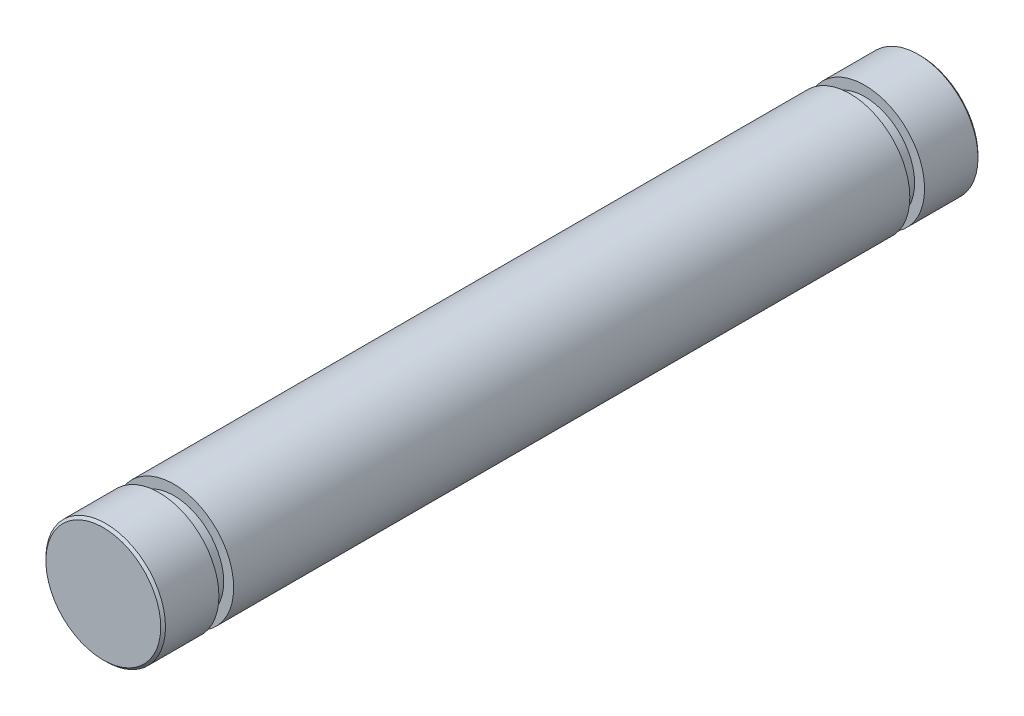
ISO-10303-21;
HEADER;
FILE_DESCRIPTION(('STEP AP214'),'2;1');
FILE_NAME('part.step','',(''),(''),'','','');
FILE_SCHEMA(('AUTOMOTIVE_DESIGN { 1 0 10303 214 1 1 1 1 }'));
ENDSEC;
DATA;
#1=APPLICATION_CONTEXT('core data for automotive mechanical design processes');
#2=APPLICATION_PROTOCOL_DEFINITION('international standard','automotive_design',2000,#1);
#3=PRODUCT_CONTEXT('',#1,'mechanical');
#4=PRODUCT('Part','Part','',(#3));
#5=PRODUCT_RELATED_PRODUCT_CATEGORY('part','',(#4));
#6=PRODUCT_DEFINITION_FORMATION('','',#4);
#7=PRODUCT_DEFINITION_CONTEXT('part definition',#1,'design');
#8=PRODUCT_DEFINITION('design','',#6,#7);
#9=PRODUCT_DEFINITION_SHAPE('','',#8);
#10=(LENGTH_UNIT() NAMED_UNIT(*) SI_UNIT(.MILLI.,.METRE.));
#11=(NAMED_UNIT(*) PLANE_ANGLE_UNIT() SI_UNIT($,.RADIAN.));
#12=(NAMED_UNIT(*) SI_UNIT($,.STERADIAN.) SOLID_ANGLE_UNIT());
#13=UNCERTAINTY_MEASURE_WITH_UNIT(LENGTH_MEASURE(1.E-05),#10,'distance_accuracy_value','');
#14=(GEOMETRIC_REPRESENTATION_CONTEXT(3) GLOBAL_UNCERTAINTY_ASSIGNED_CONTEXT((#13)) GLOBAL_UNIT_ASSIGNED_CONTEXT((#10,
#11,#12)) REPRESENTATION_CONTEXT('',''));
#15=CARTESIAN_POINT('',(0.,0.,0.));
#16=DIRECTION('',(0.,0.,1.));
#17=DIRECTION('',(1.,0.,0.));
#18=AXIS2_PLACEMENT_3D('',#15,#16,#17);
#19=CARTESIAN_POINT('',(0.,0.,20.5));
#20=DIRECTION('',(0.,0.,-1.));
#21=DIRECTION('',(-1.,0.,0.));
#22=AXIS2_PLACEMENT_3D('',#19,#20,#21);
#23=CYLINDRICAL_SURFACE('',#22,3.);
#24=CARTESIAN_POINT('',(0.,0.,16.96));
#25=DIRECTION('',(0.,0.,1.));
#26=DIRECTION('',(1.,0.,0.));
#27=AXIS2_PLACEMENT_3D('',#24,#25,#26);
#28=CIRCLE('',#27,3.);
#29=CARTESIAN_POINT('',(3.,0.,16.96));
#30=VERTEX_POINT('',#29);
#31=EDGE_CURVE('E61',#30,#30,#28,.T.);
#32=ORIENTED_EDGE('',*,*,#31,.F.);
#33=EDGE_LOOP('',(#32));
#34=FACE_BOUND('',#33,.T.);
#35=CARTESIAN_POINT('',(0.,0.,-16.96));
#36=DIRECTION('',(0.,0.,1.));
#37=DIRECTION('',(1.,0.,0.));
#38=AXIS2_PLACEMENT_3D('',#35,#36,#37);
#39=CIRCLE('',#38,3.);
#40=CARTESIAN_POINT('',(3.,0.,-16.96));
#41=VERTEX_POINT('',#40);
#42=EDGE_CURVE('E74',#41,#41,#39,.T.);
#43=ORIENTED_EDGE('',*,*,#42,.T.);
#44=EDGE_LOOP('',(#43));
#45=FACE_BOUND('',#44,.T.);
#46=ADVANCED_FACE('F37',(#34,#45),#23,.T.);
#47=CARTESIAN_POINT('',(0.,0.,16.96));
#48=DIRECTION('',(0.,0.,1.));
#49=DIRECTION('',(1.,0.,0.));
#50=AXIS2_PLACEMENT_3D('',#47,#48,#49);
#51=PLANE('',#50);
#52=CARTESIAN_POINT('',(0.,0.,16.96));
#53=DIRECTION('',(0.,0.,1.));
#54=DIRECTION('',(1.,0.,0.));
#55=AXIS2_PLACEMENT_3D('',#52,#53,#54);
#56=CIRCLE('',#55,2.5);
#57=CARTESIAN_POINT('',(2.5,0.,16.96));
#58=VERTEX_POINT('',#57);
#59=EDGE_CURVE('E66',#58,#58,#56,.T.);
#60=ORIENTED_EDGE('',*,*,#59,.F.);
#61=EDGE_LOOP('',(#60));
#62=FACE_BOUND('',#61,.T.);
#63=ORIENTED_EDGE('',*,*,#31,.T.);
#64=EDGE_LOOP('',(#63));
#65=FACE_BOUND('',#64,.T.);
#66=ADVANCED_FACE('F115',(#62,#65),#51,.T.);
#67=CARTESIAN_POINT('',(0.,0.,17.7));
#68=DIRECTION('',(0.,0.,1.));
#69=DIRECTION('',(1.,0.,0.));
#70=AXIS2_PLACEMENT_3D('',#67,#68,#69);
#71=PLANE('',#70);
#72=CARTESIAN_POINT('',(0.,0.,17.7));
#73=DIRECTION('',(0.,0.,1.));
#74=DIRECTION('',(1.,0.,0.));
#75=AXIS2_PLACEMENT_3D('',#72,#73,#74);
#76=CIRCLE('',#75,2.5);
#77=CARTESIAN_POINT('',(2.5,0.,17.7));
#78=VERTEX_POINT('',#77);
#79=EDGE_CURVE('E70',#78,#78,#76,.T.);
#80=ORIENTED_EDGE('',*,*,#79,.T.);
#81=EDGE_LOOP('',(#80));
#82=FACE_BOUND('',#81,.T.);
#83=CARTESIAN_POINT('',(0.,0.,17.7));
#84=DIRECTION('',(0.,0.,1.));
#85=DIRECTION('',(1.,0.,0.));
#86=AXIS2_PLACEMENT_3D('',#83,#84,#85);
#87=CIRCLE('',#86,3.);
#88=CARTESIAN_POINT('',(3.,0.,17.7));
#89=VERTEX_POINT('',#88);
#90=EDGE_CURVE('E62',#89,#89,#87,.T.);
#91=ORIENTED_EDGE('',*,*,#90,.F.);
#92=EDGE_LOOP('',(#91));
#93=FACE_BOUND('',#92,.T.);
#94=ADVANCED_FACE('F122',(#82,#93),#71,.F.);
#95=CARTESIAN_POINT('',(0.,0.,16.96));
#96=DIRECTION('',(0.,0.,1.));
#97=DIRECTION('',(1.,0.,0.));
#98=AXIS2_PLACEMENT_3D('',#95,#96,#97);
#99=CYLINDRICAL_SURFACE('',#98,2.5);
#100=ORIENTED_EDGE('',*,*,#59,.T.);
#101=EDGE_LOOP('',(#100));
#102=FACE_BOUND('',#101,.T.);
#103=ORIENTED_EDGE('',*,*,#79,.F.);
#104=EDGE_LOOP('',(#103));
#105=FACE_BOUND('',#104,.T.);
#106=ADVANCED_FACE('F144',(#102,#105),#99,.T.);
#107=CARTESIAN_POINT('',(0.,0.,20.5));
#108=DIRECTION('',(0.,0.,1.));
#109=DIRECTION('',(1.,0.,0.));
#110=AXIS2_PLACEMENT_3D('',#107,#108,#109);
#111=PLANE('',#110);
#112=CARTESIAN_POINT('',(0.,0.,20.5));
#113=DIRECTION('',(0.,0.,1.));
#114=DIRECTION('',(1.,0.,0.));
#115=AXIS2_PLACEMENT_3D('',#112,#113,#114);
#116=CIRCLE('',#115,2.88000000000001);
#117=CARTESIAN_POINT('',(2.88000000000001,0.,20.5));
#118=VERTEX_POINT('',#117);
#119=EDGE_CURVE('E10',#118,#118,#116,.T.);
#120=ORIENTED_EDGE('',*,*,#119,.T.);
#121=EDGE_LOOP('',(#120));
#122=FACE_BOUND('',#121,.T.);
#123=ADVANCED_FACE('F136',(#122),#111,.T.);
#124=CARTESIAN_POINT('',(0.,0.,20.5));
#125=DIRECTION('',(0.,0.,-1.));
#126=DIRECTION('',(-1.,0.,0.));
#127=AXIS2_PLACEMENT_3D('',#124,#125,#126);
#128=CONICAL_SURFACE('',#127,2.88000000000001,0.785398163397425);
#129=CARTESIAN_POINT('',(0.,0.,20.38));
#130=DIRECTION('',(0.,0.,1.));
#131=DIRECTION('',(1.,0.,0.));
#132=AXIS2_PLACEMENT_3D('',#129,#130,#131);
#133=CIRCLE('',#132,3.);
#134=CARTESIAN_POINT('',(3.,0.,20.38));
#135=VERTEX_POINT('',#134);
#136=EDGE_CURVE('E55',#135,#135,#133,.F.);
#137=ORIENTED_EDGE('',*,*,#136,.F.);
#138=EDGE_LOOP('',(#137));
#139=FACE_BOUND('',#138,.T.);
#140=ORIENTED_EDGE('',*,*,#119,.F.);
#141=EDGE_LOOP('',(#140));
#142=FACE_BOUND('',#141,.T.);
#143=ADVANCED_FACE('F39',(#139,#142),#128,.T.);
#144=ORIENTED_EDGE('',*,*,#90,.T.);
#145=EDGE_LOOP('',(#144));
#146=FACE_BOUND('',#145,.T.);
#147=ORIENTED_EDGE('',*,*,#136,.T.);
#148=EDGE_LOOP('',(#147));
#149=FACE_BOUND('',#148,.T.);
#150=ADVANCED_FACE('F110',(#146,#149),#23,.T.);
#151=CARTESIAN_POINT('',(0.,0.,-16.96));
#152=DIRECTION('',(0.,0.,-1.));
#153=DIRECTION('',(1.,0.,0.));
#154=AXIS2_PLACEMENT_3D('',#151,#152,#153);
#155=PLANE('',#154);
#156=ORIENTED_EDGE('',*,*,#42,.F.);
#157=EDGE_LOOP('',(#156));
#158=FACE_BOUND('',#157,.T.);
#159=CARTESIAN_POINT('',(0.,0.,-16.96));
#160=DIRECTION('',(0.,0.,1.));
#161=DIRECTION('',(1.,0.,0.));
#162=AXIS2_PLACEMENT_3D('',#159,#160,#161);
#163=CIRCLE('',#162,2.5);
#164=CARTESIAN_POINT('',(2.5,0.,-16.96));
#165=VERTEX_POINT('',#164);
#166=EDGE_CURVE('E82',#165,#165,#163,.T.);
#167=ORIENTED_EDGE('',*,*,#166,.T.);
#168=EDGE_LOOP('',(#167));
#169=FACE_BOUND('',#168,.T.);
#170=ADVANCED_FACE('F94',(#158,#169),#155,.T.);
#171=CARTESIAN_POINT('',(0.,0.,-17.7));
#172=DIRECTION('',(0.,0.,-1.));
#173=DIRECTION('',(1.,0.,0.));
#174=AXIS2_PLACEMENT_3D('',#171,#172,#173);
#175=PLANE('',#174);
#176=CARTESIAN_POINT('',(0.,0.,-17.7));
#177=DIRECTION('',(0.,0.,1.));
#178=DIRECTION('',(1.,0.,0.));
#179=AXIS2_PLACEMENT_3D('',#176,#177,#178);
#180=CIRCLE('',#179,3.);
#181=CARTESIAN_POINT('',(3.,0.,-17.7));
#182=VERTEX_POINT('',#181);
#183=EDGE_CURVE('E78',#182,#182,#180,.T.);
#184=ORIENTED_EDGE('',*,*,#183,.T.);
#185=EDGE_LOOP('',(#184));
#186=FACE_BOUND('',#185,.T.);
#187=CARTESIAN_POINT('',(0.,0.,-17.7));
#188=DIRECTION('',(0.,0.,1.));
#189=DIRECTION('',(1.,0.,0.));
#190=AXIS2_PLACEMENT_3D('',#187,#188,#189);
#191=CIRCLE('',#190,2.5);
#192=CARTESIAN_POINT('',(2.5,0.,-17.7));
#193=VERTEX_POINT('',#192);
#194=EDGE_CURVE('E86',#193,#193,#191,.T.);
#195=ORIENTED_EDGE('',*,*,#194,.F.);
#196=EDGE_LOOP('',(#195));
#197=FACE_BOUND('',#196,.T.);
#198=ADVANCED_FACE('F100',(#186,#197),#175,.F.);
#199=CARTESIAN_POINT('',(0.,0.,-16.96));
#200=DIRECTION('',(0.,0.,-1.));
#201=DIRECTION('',(-1.,0.,0.));
#202=AXIS2_PLACEMENT_3D('',#199,#200,#201);
#203=CYLINDRICAL_SURFACE('',#202,2.5);
#204=ORIENTED_EDGE('',*,*,#166,.F.);
#205=EDGE_LOOP('',(#204));
#206=FACE_BOUND('',#205,.T.);
#207=ORIENTED_EDGE('',*,*,#194,.T.);
#208=EDGE_LOOP('',(#207));
#209=FACE_BOUND('',#208,.T.);
#210=ADVANCED_FACE('F96',(#206,#209),#203,.T.);
#211=CARTESIAN_POINT('',(0.,0.,-20.5));
#212=DIRECTION('',(0.,0.,1.));
#213=DIRECTION('',(1.,0.,0.));
#214=AXIS2_PLACEMENT_3D('',#211,#212,#213);
#215=PLANE('',#214);
#216=CARTESIAN_POINT('',(0.,0.,-20.5));
#217=DIRECTION('',(0.,0.,1.));
#218=DIRECTION('',(1.,0.,0.));
#219=AXIS2_PLACEMENT_3D('',#216,#217,#218);
#220=CIRCLE('',#219,2.88000000000001);
#221=CARTESIAN_POINT('',(2.88000000000001,0.,-20.5));
#222=VERTEX_POINT('',#221);
#223=EDGE_CURVE('E45',#222,#222,#220,.F.);
#224=ORIENTED_EDGE('',*,*,#223,.T.);
#225=EDGE_LOOP('',(#224));
#226=FACE_BOUND('',#225,.T.);
#227=ADVANCED_FACE('F99',(#226),#215,.F.);
#228=CARTESIAN_POINT('',(0.,0.,-20.38));
#229=DIRECTION('',(0.,0.,1.));
#230=DIRECTION('',(1.,0.,0.));
#231=AXIS2_PLACEMENT_3D('',#228,#229,#230);
#232=CONICAL_SURFACE('',#231,3.,0.785398163397468);
#233=ORIENTED_EDGE('',*,*,#223,.F.);
#234=EDGE_LOOP('',(#233));
#235=FACE_BOUND('',#234,.T.);
#236=CARTESIAN_POINT('',(0.,0.,-20.38));
#237=DIRECTION('',(0.,0.,1.));
#238=DIRECTION('',(1.,0.,0.));
#239=AXIS2_PLACEMENT_3D('',#236,#237,#238);
#240=CIRCLE('',#239,3.);
#241=CARTESIAN_POINT('',(3.,0.,-20.38));
#242=VERTEX_POINT('',#241);
#243=EDGE_CURVE('E50',#242,#242,#240,.T.);
#244=ORIENTED_EDGE('',*,*,#243,.F.);
#245=EDGE_LOOP('',(#244));
#246=FACE_BOUND('',#245,.T.);
#247=ADVANCED_FACE('F129',(#235,#246),#232,.T.);
#248=ORIENTED_EDGE('',*,*,#183,.F.);
#249=EDGE_LOOP('',(#248));
#250=FACE_BOUND('',#249,.T.);
#251=ORIENTED_EDGE('',*,*,#243,.T.);
#252=EDGE_LOOP('',(#251));
#253=FACE_BOUND('',#252,.T.);
#254=ADVANCED_FACE('F118',(#250,#253),#23,.T.);
#255=CLOSED_SHELL('',(#46,#66,#94,#106,#123,#143,#150,#170,#198,#210,#227,#247,#254));
#256=MANIFOLD_SOLID_BREP('B2',#255);
#257=ADVANCED_BREP_SHAPE_REPRESENTATION('',(#18,#256),#14);
#258=SHAPE_DEFINITION_REPRESENTATION(#9,#257);
ENDSEC;
END-ISO-10303-21;
